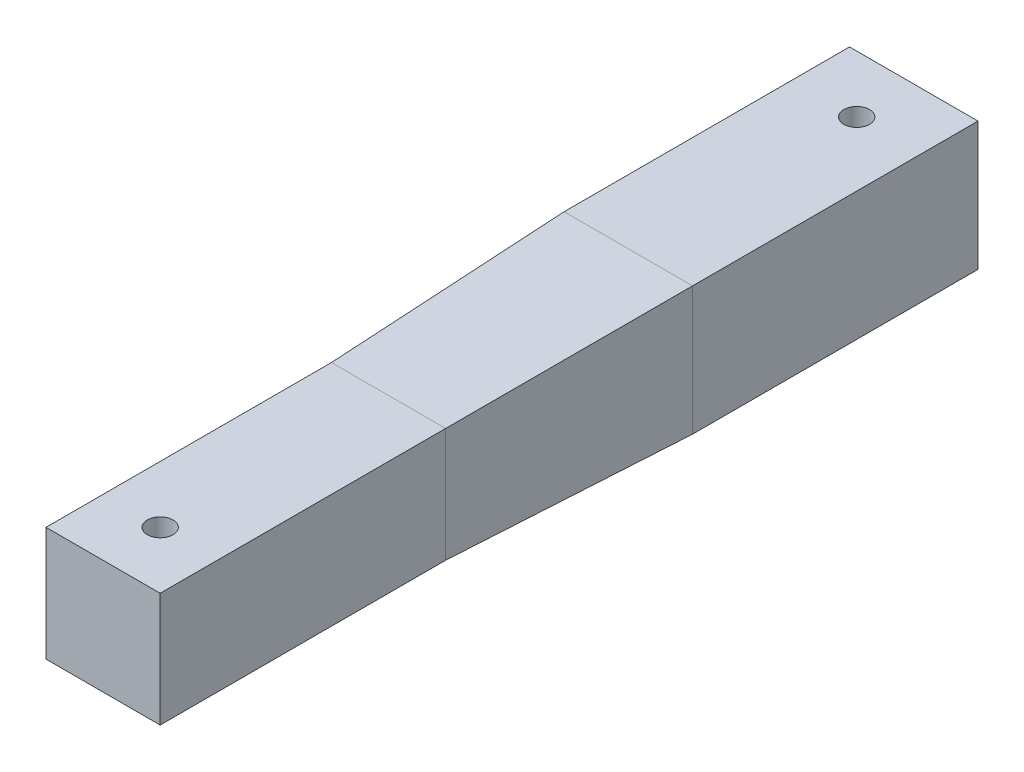
ISO-10303-21;
HEADER;
FILE_DESCRIPTION(('STEP AP214'),'2;1');
FILE_NAME('part.step','',(''),(''),'','','');
FILE_SCHEMA(('AUTOMOTIVE_DESIGN { 1 0 10303 214 1 1 1 1 }'));
ENDSEC;
DATA;
#1=APPLICATION_CONTEXT('core data for automotive mechanical design processes');
#2=APPLICATION_PROTOCOL_DEFINITION('international standard','automotive_design',2000,#1);
#3=PRODUCT_CONTEXT('',#1,'mechanical');
#4=PRODUCT('Part','Part','',(#3));
#5=PRODUCT_RELATED_PRODUCT_CATEGORY('part','',(#4));
#6=PRODUCT_DEFINITION_FORMATION('','',#4);
#7=PRODUCT_DEFINITION_CONTEXT('part definition',#1,'design');
#8=PRODUCT_DEFINITION('design','',#6,#7);
#9=PRODUCT_DEFINITION_SHAPE('','',#8);
#10=(LENGTH_UNIT() NAMED_UNIT(*) SI_UNIT(.MILLI.,.METRE.));
#11=(NAMED_UNIT(*) PLANE_ANGLE_UNIT() SI_UNIT($,.RADIAN.));
#12=(NAMED_UNIT(*) SI_UNIT($,.STERADIAN.) SOLID_ANGLE_UNIT());
#13=UNCERTAINTY_MEASURE_WITH_UNIT(LENGTH_MEASURE(1.E-05),#10,'distance_accuracy_value','');
#14=(GEOMETRIC_REPRESENTATION_CONTEXT(3) GLOBAL_UNCERTAINTY_ASSIGNED_CONTEXT((#13)) GLOBAL_UNIT_ASSIGNED_CONTEXT((#10,
#11,#12)) REPRESENTATION_CONTEXT('',''));
#15=CARTESIAN_POINT('',(0.,0.,0.));
#16=DIRECTION('',(0.,0.,1.));
#17=DIRECTION('',(1.,0.,0.));
#18=AXIS2_PLACEMENT_3D('',#15,#16,#17);
#19=CARTESIAN_POINT('',(-42.8650097465887,18.,50.));
#20=DIRECTION('',(1.,0.,0.));
#21=DIRECTION('',(0.,0.,-1.));
#22=AXIS2_PLACEMENT_3D('',#19,#20,#21);
#23=PLANE('',#22);
#24=DIRECTION('',(0.,1.,0.));
#25=VECTOR('',#24,1.);
#26=CARTESIAN_POINT('',(-42.8650097465887,18.,0.));
#27=LINE('',#26,#25);
#28=CARTESIAN_POINT('',(-42.8650097465887,18.,0.));
#29=VERTEX_POINT('',#28);
#30=CARTESIAN_POINT('',(-42.8650097465887,-2.00000000000001,0.));
#31=VERTEX_POINT('',#30);
#32=EDGE_CURVE('E92',#29,#31,#27,.F.);
#33=ORIENTED_EDGE('',*,*,#32,.T.);
#34=DIRECTION('',(0.,0.,-1.));
#35=VECTOR('',#34,1.);
#36=CARTESIAN_POINT('',(-42.8650097465887,-2.00000000000001,50.));
#37=LINE('',#36,#35);
#38=CARTESIAN_POINT('',(-42.8650097465887,-2.00000000000001,50.));
#39=VERTEX_POINT('',#38);
#40=EDGE_CURVE('E12',#39,#31,#37,.T.);
#41=ORIENTED_EDGE('',*,*,#40,.F.);
#42=DIRECTION('',(0.,-1.,0.));
#43=VECTOR('',#42,1.);
#44=CARTESIAN_POINT('',(-42.8650097465887,18.,50.));
#45=LINE('',#44,#43);
#46=CARTESIAN_POINT('',(-42.8650097465887,18.,50.));
#47=VERTEX_POINT('',#46);
#48=EDGE_CURVE('E126',#47,#39,#45,.T.);
#49=ORIENTED_EDGE('',*,*,#48,.F.);
#50=DIRECTION('',(0.,0.,-1.));
#51=VECTOR('',#50,1.);
#52=CARTESIAN_POINT('',(-42.8650097465887,18.,50.));
#53=LINE('',#52,#51);
#54=EDGE_CURVE('E121',#47,#29,#53,.T.);
#55=ORIENTED_EDGE('',*,*,#54,.T.);
#56=EDGE_LOOP('',(#33,#41,#49,#55));
#57=FACE_BOUND('',#56,.T.);
#58=ADVANCED_FACE('F46',(#57),#23,.F.);
#59=CARTESIAN_POINT('',(-42.8650097465887,-2.00000000000001,50.));
#60=DIRECTION('',(0.,1.,0.));
#61=DIRECTION('',(0.,0.,1.));
#62=AXIS2_PLACEMENT_3D('',#59,#60,#61);
#63=PLANE('',#62);
#64=CARTESIAN_POINT('',(-32.8650097465887,-2.00000000000001,40.));
#65=DIRECTION('',(0.,-1.,0.));
#66=DIRECTION('',(0.,0.,-1.));
#67=AXIS2_PLACEMENT_3D('',#64,#65,#66);
#68=CIRCLE('',#67,2.25);
#69=CARTESIAN_POINT('',(-32.8650097465887,-2.00000000000001,37.75));
#70=VERTEX_POINT('',#69);
#71=EDGE_CURVE('E374',#70,#70,#68,.T.);
#72=ORIENTED_EDGE('',*,*,#71,.F.);
#73=EDGE_LOOP('',(#72));
#74=FACE_BOUND('',#73,.T.);
#75=DIRECTION('',(1.,0.,0.));
#76=VECTOR('',#75,1.);
#77=CARTESIAN_POINT('',(-42.8650097465887,-2.00000000000001,0.));
#78=LINE('',#77,#76);
#79=CARTESIAN_POINT('',(-22.8650097465887,-2.00000000000001,0.));
#80=VERTEX_POINT('',#79);
#81=EDGE_CURVE('E105',#31,#80,#78,.T.);
#82=ORIENTED_EDGE('',*,*,#81,.T.);
#83=DIRECTION('',(0.,0.,-1.));
#84=VECTOR('',#83,1.);
#85=CARTESIAN_POINT('',(-22.8650097465887,-2.00000000000001,50.));
#86=LINE('',#85,#84);
#87=CARTESIAN_POINT('',(-22.8650097465887,-2.00000000000001,50.));
#88=VERTEX_POINT('',#87);
#89=EDGE_CURVE('E57',#88,#80,#86,.T.);
#90=ORIENTED_EDGE('',*,*,#89,.F.);
#91=DIRECTION('',(1.,0.,0.));
#92=VECTOR('',#91,1.);
#93=CARTESIAN_POINT('',(-42.8650097465887,-2.00000000000001,50.));
#94=LINE('',#93,#92);
#95=EDGE_CURVE('E322',#39,#88,#94,.T.);
#96=ORIENTED_EDGE('',*,*,#95,.F.);
#97=ORIENTED_EDGE('',*,*,#40,.T.);
#98=EDGE_LOOP('',(#82,#90,#96,#97));
#99=FACE_BOUND('',#98,.T.);
#100=ADVANCED_FACE('F335',(#74,#99),#63,.F.);
#101=CARTESIAN_POINT('',(-22.8650097465887,18.,50.));
#102=DIRECTION('',(-1.,0.,0.));
#103=DIRECTION('',(0.,-1.,0.));
#104=AXIS2_PLACEMENT_3D('',#101,#102,#103);
#105=PLANE('',#104);
#106=DIRECTION('',(0.,-1.,0.));
#107=VECTOR('',#106,1.);
#108=CARTESIAN_POINT('',(-22.8650097465887,18.,0.));
#109=LINE('',#108,#107);
#110=CARTESIAN_POINT('',(-22.8650097465887,18.,0.));
#111=VERTEX_POINT('',#110);
#112=EDGE_CURVE('E127',#80,#111,#109,.F.);
#113=ORIENTED_EDGE('',*,*,#112,.T.);
#114=DIRECTION('',(0.,0.,-1.));
#115=VECTOR('',#114,1.);
#116=CARTESIAN_POINT('',(-22.8650097465887,18.,50.));
#117=LINE('',#116,#115);
#118=CARTESIAN_POINT('',(-22.8650097465887,18.,50.));
#119=VERTEX_POINT('',#118);
#120=EDGE_CURVE('E124',#119,#111,#117,.T.);
#121=ORIENTED_EDGE('',*,*,#120,.F.);
#122=DIRECTION('',(0.,1.,0.));
#123=VECTOR('',#122,1.);
#124=CARTESIAN_POINT('',(-22.8650097465887,18.,50.));
#125=LINE('',#124,#123);
#126=EDGE_CURVE('E134',#88,#119,#125,.T.);
#127=ORIENTED_EDGE('',*,*,#126,.F.);
#128=ORIENTED_EDGE('',*,*,#89,.T.);
#129=EDGE_LOOP('',(#113,#121,#127,#128));
#130=FACE_BOUND('',#129,.T.);
#131=ADVANCED_FACE('F332',(#130),#105,.F.);
#132=CARTESIAN_POINT('',(-42.8650097465887,18.,50.));
#133=DIRECTION('',(0.,-1.,0.));
#134=DIRECTION('',(0.,0.,-1.));
#135=AXIS2_PLACEMENT_3D('',#132,#133,#134);
#136=PLANE('',#135);
#137=CARTESIAN_POINT('',(-32.8650097465887,18.,40.));
#138=DIRECTION('',(0.,-1.,0.));
#139=DIRECTION('',(0.,0.,-1.));
#140=AXIS2_PLACEMENT_3D('',#137,#138,#139);
#141=CIRCLE('',#140,2.25);
#142=CARTESIAN_POINT('',(-32.8650097465887,18.,37.75));
#143=VERTEX_POINT('',#142);
#144=EDGE_CURVE('E367',#143,#143,#141,.F.);
#145=ORIENTED_EDGE('',*,*,#144,.F.);
#146=EDGE_LOOP('',(#145));
#147=FACE_BOUND('',#146,.T.);
#148=DIRECTION('',(1.,0.,0.));
#149=VECTOR('',#148,1.);
#150=CARTESIAN_POINT('',(-42.8650097465887,18.,0.));
#151=LINE('',#150,#149);
#152=EDGE_CURVE('E111',#111,#29,#151,.F.);
#153=ORIENTED_EDGE('',*,*,#152,.T.);
#154=ORIENTED_EDGE('',*,*,#54,.F.);
#155=DIRECTION('',(-1.,0.,0.));
#156=VECTOR('',#155,1.);
#157=CARTESIAN_POINT('',(-42.8650097465887,18.,50.));
#158=LINE('',#157,#156);
#159=EDGE_CURVE('E66',#119,#47,#158,.T.);
#160=ORIENTED_EDGE('',*,*,#159,.F.);
#161=ORIENTED_EDGE('',*,*,#120,.T.);
#162=EDGE_LOOP('',(#153,#154,#160,#161));
#163=FACE_BOUND('',#162,.T.);
#164=ADVANCED_FACE('F120',(#147,#163),#136,.F.);
#165=CARTESIAN_POINT('',(0.,0.,50.));
#166=DIRECTION('',(0.,0.,1.));
#167=DIRECTION('',(1.,0.,0.));
#168=AXIS2_PLACEMENT_3D('',#165,#166,#167);
#169=PLANE('',#168);
#170=ORIENTED_EDGE('',*,*,#48,.T.);
#171=ORIENTED_EDGE('',*,*,#95,.T.);
#172=ORIENTED_EDGE('',*,*,#126,.T.);
#173=ORIENTED_EDGE('',*,*,#159,.T.);
#174=EDGE_LOOP('',(#170,#171,#172,#173));
#175=FACE_BOUND('',#174,.T.);
#176=ADVANCED_FACE('F264',(#175),#169,.T.);
#177=CARTESIAN_POINT('',(0.,17.9840702325746,0.535240185493292));
#178=DIRECTION('',(0.,0.999557408516795,0.0297487323963332));
#179=DIRECTION('',(0.,-0.0297487323963332,0.999557408516795));
#180=AXIS2_PLACEMENT_3D('',#177,#178,#179);
#181=PLANE('',#180);
#182=DIRECTION('',(0.0297355775052244,-0.0297355775052246,0.999115404175544));
#183=VECTOR('',#182,1.);
#184=CARTESIAN_POINT('',(-44.1150097465887,19.25,-42.));
#185=LINE('',#184,#183);
#186=CARTESIAN_POINT('',(-44.1150097465887,19.25,-42.));
#187=VERTEX_POINT('',#186);
#188=EDGE_CURVE('E97',#187,#29,#185,.T.);
#189=ORIENTED_EDGE('',*,*,#188,.T.);
#190=ORIENTED_EDGE('',*,*,#152,.F.);
#191=DIRECTION('',(-0.0297355775052245,-0.0297355775052246,0.999115404175544));
#192=VECTOR('',#191,1.);
#193=CARTESIAN_POINT('',(-21.6150097465887,19.25,-42.));
#194=LINE('',#193,#192);
#195=CARTESIAN_POINT('',(-21.6150097465887,19.25,-42.));
#196=VERTEX_POINT('',#195);
#197=EDGE_CURVE('E85',#196,#111,#194,.T.);
#198=ORIENTED_EDGE('',*,*,#197,.F.);
#199=DIRECTION('',(-1.,0.,0.));
#200=VECTOR('',#199,1.);
#201=CARTESIAN_POINT('',(-44.1150097465887,19.25,-42.));
#202=LINE('',#201,#200);
#203=EDGE_CURVE('E114',#196,#187,#202,.T.);
#204=ORIENTED_EDGE('',*,*,#203,.T.);
#205=EDGE_LOOP('',(#189,#190,#198,#204));
#206=FACE_BOUND('',#205,.T.);
#207=ADVANCED_FACE('F110',(#206),#181,.T.);
#208=CARTESIAN_POINT('',(-22.8447745083974,0.,-0.679904003226113));
#209=DIRECTION('',(0.999557408516795,0.,0.0297487323963331));
#210=DIRECTION('',(0.0297487323963331,0.,-0.999557408516795));
#211=AXIS2_PLACEMENT_3D('',#208,#209,#210);
#212=PLANE('',#211);
#213=ORIENTED_EDGE('',*,*,#197,.T.);
#214=ORIENTED_EDGE('',*,*,#112,.F.);
#215=DIRECTION('',(-0.0297355775052245,0.0297355775052245,0.999115404175544));
#216=VECTOR('',#215,1.);
#217=CARTESIAN_POINT('',(-21.6150097465887,-3.25000000000001,-42.));
#218=LINE('',#217,#216);
#219=CARTESIAN_POINT('',(-21.6150097465887,-3.25000000000001,-42.));
#220=VERTEX_POINT('',#219);
#221=EDGE_CURVE('E106',#220,#80,#218,.T.);
#222=ORIENTED_EDGE('',*,*,#221,.F.);
#223=DIRECTION('',(0.,1.,0.));
#224=VECTOR('',#223,1.);
#225=CARTESIAN_POINT('',(-21.6150097465887,19.25,-42.));
#226=LINE('',#225,#224);
#227=EDGE_CURVE('E49',#220,#196,#226,.T.);
#228=ORIENTED_EDGE('',*,*,#227,.T.);
#229=EDGE_LOOP('',(#213,#214,#222,#228));
#230=FACE_BOUND('',#229,.T.);
#231=ADVANCED_FACE('F263',(#230),#212,.T.);
#232=CARTESIAN_POINT('',(-42.8270747668137,0.,1.27461532044088));
#233=DIRECTION('',(-0.999557408516795,0.,0.0297487323963331));
#234=DIRECTION('',(0.0297487323963331,0.,0.999557408516795));
#235=AXIS2_PLACEMENT_3D('',#232,#233,#234);
#236=PLANE('',#235);
#237=DIRECTION('',(0.0297355775052244,0.0297355775052245,0.999115404175544));
#238=VECTOR('',#237,1.);
#239=CARTESIAN_POINT('',(-44.1150097465887,-3.25000000000001,-42.));
#240=LINE('',#239,#238);
#241=CARTESIAN_POINT('',(-44.1150097465887,-3.25000000000001,-42.));
#242=VERTEX_POINT('',#241);
#243=EDGE_CURVE('E100',#242,#31,#240,.T.);
#244=ORIENTED_EDGE('',*,*,#243,.T.);
#245=ORIENTED_EDGE('',*,*,#32,.F.);
#246=ORIENTED_EDGE('',*,*,#188,.F.);
#247=DIRECTION('',(0.,-1.,0.));
#248=VECTOR('',#247,1.);
#249=CARTESIAN_POINT('',(-44.1150097465887,19.25,-42.));
#250=LINE('',#249,#248);
#251=EDGE_CURVE('E213',#187,#242,#250,.T.);
#252=ORIENTED_EDGE('',*,*,#251,.T.);
#253=EDGE_LOOP('',(#244,#245,#246,#252));
#254=FACE_BOUND('',#253,.T.);
#255=ADVANCED_FACE('F94',(#254),#236,.T.);
#256=CARTESIAN_POINT('',(0.,-1.99823002584164,0.0594711317214771));
#257=DIRECTION('',(0.,-0.999557408516795,0.0297487323963331));
#258=DIRECTION('',(0.,-0.0297487323963331,-0.999557408516795));
#259=AXIS2_PLACEMENT_3D('',#256,#257,#258);
#260=PLANE('',#259);
#261=ORIENTED_EDGE('',*,*,#221,.T.);
#262=ORIENTED_EDGE('',*,*,#81,.F.);
#263=ORIENTED_EDGE('',*,*,#243,.F.);
#264=DIRECTION('',(1.,0.,0.));
#265=VECTOR('',#264,1.);
#266=CARTESIAN_POINT('',(-44.1150097465887,-3.25000000000001,-42.));
#267=LINE('',#266,#265);
#268=EDGE_CURVE('E158',#242,#220,#267,.T.);
#269=ORIENTED_EDGE('',*,*,#268,.T.);
#270=EDGE_LOOP('',(#261,#262,#263,#269));
#271=FACE_BOUND('',#270,.T.);
#272=ADVANCED_FACE('F260',(#271),#260,.T.);
#273=CARTESIAN_POINT('',(-44.1150097465887,19.25,-42.));
#274=DIRECTION('',(-1.,0.,0.));
#275=DIRECTION('',(0.,0.,1.));
#276=AXIS2_PLACEMENT_3D('',#273,#274,#275);
#277=PLANE('',#276);
#278=DIRECTION('',(0.,1.,0.));
#279=VECTOR('',#278,1.);
#280=CARTESIAN_POINT('',(-44.1150097465887,19.25,-92.));
#281=LINE('',#280,#279);
#282=CARTESIAN_POINT('',(-44.1150097465887,-3.25000000000001,-92.));
#283=VERTEX_POINT('',#282);
#284=CARTESIAN_POINT('',(-44.1150097465887,19.25,-92.));
#285=VERTEX_POINT('',#284);
#286=EDGE_CURVE('E350',#283,#285,#281,.T.);
#287=ORIENTED_EDGE('',*,*,#286,.F.);
#288=DIRECTION('',(0.,0.,-1.));
#289=VECTOR('',#288,1.);
#290=CARTESIAN_POINT('',(-44.1150097465887,-3.25000000000001,-42.));
#291=LINE('',#290,#289);
#292=EDGE_CURVE('E147',#242,#283,#291,.T.);
#293=ORIENTED_EDGE('',*,*,#292,.F.);
#294=ORIENTED_EDGE('',*,*,#251,.F.);
#295=DIRECTION('',(0.,0.,-1.));
#296=VECTOR('',#295,1.);
#297=CARTESIAN_POINT('',(-44.1150097465887,19.25,-42.));
#298=LINE('',#297,#296);
#299=EDGE_CURVE('E232',#187,#285,#298,.T.);
#300=ORIENTED_EDGE('',*,*,#299,.T.);
#301=EDGE_LOOP('',(#287,#293,#294,#300));
#302=FACE_BOUND('',#301,.T.);
#303=ADVANCED_FACE('F175',(#302),#277,.T.);
#304=CARTESIAN_POINT('',(-44.1150097465887,-3.25000000000001,-42.));
#305=DIRECTION('',(0.,-1.,0.));
#306=DIRECTION('',(1.,0.,0.));
#307=AXIS2_PLACEMENT_3D('',#304,#305,#306);
#308=PLANE('',#307);
#309=CARTESIAN_POINT('',(-32.8650097465887,-3.25000000000001,-82.));
#310=DIRECTION('',(0.,-1.,0.));
#311=DIRECTION('',(1.,0.,0.));
#312=AXIS2_PLACEMENT_3D('',#309,#310,#311);
#313=CIRCLE('',#312,2.25);
#314=CARTESIAN_POINT('',(-30.6150097465887,-3.25000000000001,-82.));
#315=VERTEX_POINT('',#314);
#316=EDGE_CURVE('E363',#315,#315,#313,.F.);
#317=ORIENTED_EDGE('',*,*,#316,.T.);
#318=EDGE_LOOP('',(#317));
#319=FACE_BOUND('',#318,.T.);
#320=DIRECTION('',(-1.,0.,0.));
#321=VECTOR('',#320,1.);
#322=CARTESIAN_POINT('',(-44.1150097465887,-3.25000000000001,-92.));
#323=LINE('',#322,#321);
#324=CARTESIAN_POINT('',(-21.6150097465887,-3.25000000000001,-92.));
#325=VERTEX_POINT('',#324);
#326=EDGE_CURVE('E238',#325,#283,#323,.T.);
#327=ORIENTED_EDGE('',*,*,#326,.F.);
#328=DIRECTION('',(0.,0.,-1.));
#329=VECTOR('',#328,1.);
#330=CARTESIAN_POINT('',(-21.6150097465887,-3.25000000000001,-42.));
#331=LINE('',#330,#329);
#332=EDGE_CURVE('E143',#220,#325,#331,.T.);
#333=ORIENTED_EDGE('',*,*,#332,.F.);
#334=ORIENTED_EDGE('',*,*,#268,.F.);
#335=ORIENTED_EDGE('',*,*,#292,.T.);
#336=EDGE_LOOP('',(#327,#333,#334,#335));
#337=FACE_BOUND('',#336,.T.);
#338=ADVANCED_FACE('F164',(#319,#337),#308,.T.);
#339=CARTESIAN_POINT('',(-21.6150097465887,19.25,-42.));
#340=DIRECTION('',(1.,0.,0.));
#341=DIRECTION('',(0.,1.,0.));
#342=AXIS2_PLACEMENT_3D('',#339,#340,#341);
#343=PLANE('',#342);
#344=DIRECTION('',(0.,-1.,0.));
#345=VECTOR('',#344,1.);
#346=CARTESIAN_POINT('',(-21.6150097465887,19.25,-92.));
#347=LINE('',#346,#345);
#348=CARTESIAN_POINT('',(-21.6150097465887,19.25,-92.));
#349=VERTEX_POINT('',#348);
#350=EDGE_CURVE('E245',#349,#325,#347,.T.);
#351=ORIENTED_EDGE('',*,*,#350,.F.);
#352=DIRECTION('',(0.,0.,-1.));
#353=VECTOR('',#352,1.);
#354=CARTESIAN_POINT('',(-21.6150097465887,19.25,-42.));
#355=LINE('',#354,#353);
#356=EDGE_CURVE('E148',#196,#349,#355,.T.);
#357=ORIENTED_EDGE('',*,*,#356,.F.);
#358=ORIENTED_EDGE('',*,*,#227,.F.);
#359=ORIENTED_EDGE('',*,*,#332,.T.);
#360=EDGE_LOOP('',(#351,#357,#358,#359));
#361=FACE_BOUND('',#360,.T.);
#362=ADVANCED_FACE('F174',(#361),#343,.T.);
#363=CARTESIAN_POINT('',(-44.1150097465887,19.25,-42.));
#364=DIRECTION('',(0.,1.,0.));
#365=DIRECTION('',(0.,0.,1.));
#366=AXIS2_PLACEMENT_3D('',#363,#364,#365);
#367=PLANE('',#366);
#368=CARTESIAN_POINT('',(-32.8650097465887,19.25,-82.));
#369=DIRECTION('',(0.,1.,0.));
#370=DIRECTION('',(0.,0.,1.));
#371=AXIS2_PLACEMENT_3D('',#368,#369,#370);
#372=CIRCLE('',#371,2.25);
#373=CARTESIAN_POINT('',(-32.8650097465887,19.25,-79.75));
#374=VERTEX_POINT('',#373);
#375=EDGE_CURVE('E362',#374,#374,#372,.T.);
#376=ORIENTED_EDGE('',*,*,#375,.F.);
#377=EDGE_LOOP('',(#376));
#378=FACE_BOUND('',#377,.T.);
#379=DIRECTION('',(1.,0.,0.));
#380=VECTOR('',#379,1.);
#381=CARTESIAN_POINT('',(-44.1150097465887,19.25,-92.));
#382=LINE('',#381,#380);
#383=EDGE_CURVE('E348',#285,#349,#382,.T.);
#384=ORIENTED_EDGE('',*,*,#383,.F.);
#385=ORIENTED_EDGE('',*,*,#299,.F.);
#386=ORIENTED_EDGE('',*,*,#203,.F.);
#387=ORIENTED_EDGE('',*,*,#356,.T.);
#388=EDGE_LOOP('',(#384,#385,#386,#387));
#389=FACE_BOUND('',#388,.T.);
#390=ADVANCED_FACE('F182',(#378,#389),#367,.T.);
#391=CARTESIAN_POINT('',(0.,0.,-92.));
#392=DIRECTION('',(0.,0.,1.));
#393=DIRECTION('',(1.,0.,0.));
#394=AXIS2_PLACEMENT_3D('',#391,#392,#393);
#395=PLANE('',#394);
#396=ORIENTED_EDGE('',*,*,#286,.T.);
#397=ORIENTED_EDGE('',*,*,#383,.T.);
#398=ORIENTED_EDGE('',*,*,#350,.T.);
#399=ORIENTED_EDGE('',*,*,#326,.T.);
#400=EDGE_LOOP('',(#396,#397,#398,#399));
#401=FACE_BOUND('',#400,.T.);
#402=ADVANCED_FACE('F177',(#401),#395,.F.);
#403=CARTESIAN_POINT('',(-32.8650097465887,-3.25110000000001,-82.));
#404=DIRECTION('',(0.,1.,0.));
#405=DIRECTION('',(0.,0.,1.));
#406=AXIS2_PLACEMENT_3D('',#403,#404,#405);
#407=CYLINDRICAL_SURFACE('',#406,2.25);
#408=ORIENTED_EDGE('',*,*,#316,.F.);
#409=EDGE_LOOP('',(#408));
#410=FACE_BOUND('',#409,.T.);
#411=ORIENTED_EDGE('',*,*,#375,.T.);
#412=EDGE_LOOP('',(#411));
#413=FACE_BOUND('',#412,.T.);
#414=ADVANCED_FACE('F395',(#410,#413),#407,.F.);
#415=CARTESIAN_POINT('',(-32.8650097465887,19.2511,40.));
#416=DIRECTION('',(0.,-1.,0.));
#417=DIRECTION('',(0.,0.,-1.));
#418=AXIS2_PLACEMENT_3D('',#415,#416,#417);
#419=CYLINDRICAL_SURFACE('',#418,2.25);
#420=ORIENTED_EDGE('',*,*,#71,.T.);
#421=EDGE_LOOP('',(#420));
#422=FACE_BOUND('',#421,.T.);
#423=ORIENTED_EDGE('',*,*,#144,.T.);
#424=EDGE_LOOP('',(#423));
#425=FACE_BOUND('',#424,.T.);
#426=ADVANCED_FACE('F379',(#422,#425),#419,.F.);
#427=CLOSED_SHELL('',(#58,#100,#131,#164,#176,#207,#231,#255,#272,#303,#338,#362,#390,#402,#414,#426));
#428=MANIFOLD_SOLID_BREP('B2',#427);
#429=ADVANCED_BREP_SHAPE_REPRESENTATION('',(#18,#428),#14);
#430=SHAPE_DEFINITION_REPRESENTATION(#9,#429);
ENDSEC;
END-ISO-10303-21;
